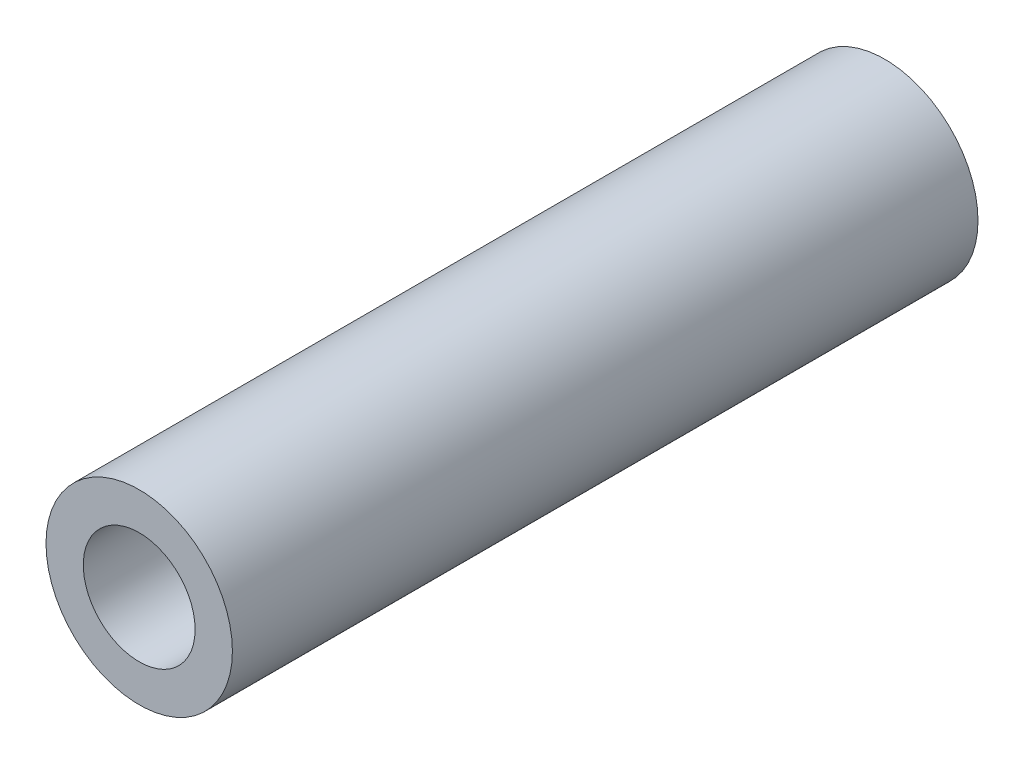
ISO-10303-21;
HEADER;
FILE_DESCRIPTION(('STEP AP214'),'2;1');
FILE_NAME('part.step','',(''),(''),'','','');
FILE_SCHEMA(('AUTOMOTIVE_DESIGN { 1 0 10303 214 1 1 1 1 }'));
ENDSEC;
DATA;
#1=APPLICATION_CONTEXT('core data for automotive mechanical design processes');
#2=APPLICATION_PROTOCOL_DEFINITION('international standard','automotive_design',2000,#1);
#3=PRODUCT_CONTEXT('',#1,'mechanical');
#4=PRODUCT('Part','Part','',(#3));
#5=PRODUCT_RELATED_PRODUCT_CATEGORY('part','',(#4));
#6=PRODUCT_DEFINITION_FORMATION('','',#4);
#7=PRODUCT_DEFINITION_CONTEXT('part definition',#1,'design');
#8=PRODUCT_DEFINITION('design','',#6,#7);
#9=PRODUCT_DEFINITION_SHAPE('','',#8);
#10=(LENGTH_UNIT() NAMED_UNIT(*) SI_UNIT(.MILLI.,.METRE.));
#11=(NAMED_UNIT(*) PLANE_ANGLE_UNIT() SI_UNIT($,.RADIAN.));
#12=(NAMED_UNIT(*) SI_UNIT($,.STERADIAN.) SOLID_ANGLE_UNIT());
#13=UNCERTAINTY_MEASURE_WITH_UNIT(LENGTH_MEASURE(1.E-05),#10,'distance_accuracy_value','');
#14=(GEOMETRIC_REPRESENTATION_CONTEXT(3) GLOBAL_UNCERTAINTY_ASSIGNED_CONTEXT((#13)) GLOBAL_UNIT_ASSIGNED_CONTEXT((#10,
#11,#12)) REPRESENTATION_CONTEXT('',''));
#15=CARTESIAN_POINT('',(0.,0.,0.));
#16=DIRECTION('',(0.,0.,1.));
#17=DIRECTION('',(1.,0.,0.));
#18=AXIS2_PLACEMENT_3D('',#15,#16,#17);
#19=CARTESIAN_POINT('',(0.,0.,10.));
#20=DIRECTION('',(0.,0.,1.));
#21=DIRECTION('',(1.,0.,0.));
#22=AXIS2_PLACEMENT_3D('',#19,#20,#21);
#23=PLANE('',#22);
#24=CARTESIAN_POINT('',(0.,0.,10.));
#25=DIRECTION('',(0.,0.,1.));
#26=DIRECTION('',(1.,0.,0.));
#27=AXIS2_PLACEMENT_3D('',#24,#25,#26);
#28=CIRCLE('',#27,2.5);
#29=CARTESIAN_POINT('',(2.5,0.,10.));
#30=VERTEX_POINT('',#29);
#31=EDGE_CURVE('E10',#30,#30,#28,.T.);
#32=ORIENTED_EDGE('',*,*,#31,.T.);
#33=EDGE_LOOP('',(#32));
#34=FACE_BOUND('',#33,.T.);
#35=CARTESIAN_POINT('',(0.,0.,10.));
#36=DIRECTION('',(0.,0.,1.));
#37=DIRECTION('',(1.,0.,0.));
#38=AXIS2_PLACEMENT_3D('',#35,#36,#37);
#39=CIRCLE('',#38,1.5);
#40=CARTESIAN_POINT('',(1.5,0.,10.));
#41=VERTEX_POINT('',#40);
#42=EDGE_CURVE('E41',#41,#41,#39,.T.);
#43=ORIENTED_EDGE('',*,*,#42,.F.);
#44=EDGE_LOOP('',(#43));
#45=FACE_BOUND('',#44,.T.);
#46=ADVANCED_FACE('F30',(#34,#45),#23,.T.);
#47=CARTESIAN_POINT('',(0.,0.,-10.));
#48=DIRECTION('',(0.,0.,1.));
#49=DIRECTION('',(1.,0.,0.));
#50=AXIS2_PLACEMENT_3D('',#47,#48,#49);
#51=PLANE('',#50);
#52=CARTESIAN_POINT('',(0.,0.,-10.));
#53=DIRECTION('',(0.,0.,1.));
#54=DIRECTION('',(1.,0.,0.));
#55=AXIS2_PLACEMENT_3D('',#52,#53,#54);
#56=CIRCLE('',#55,2.5);
#57=CARTESIAN_POINT('',(2.5,0.,-10.));
#58=VERTEX_POINT('',#57);
#59=EDGE_CURVE('E34',#58,#58,#56,.T.);
#60=ORIENTED_EDGE('',*,*,#59,.F.);
#61=EDGE_LOOP('',(#60));
#62=FACE_BOUND('',#61,.T.);
#63=CARTESIAN_POINT('',(0.,0.,-10.));
#64=DIRECTION('',(0.,0.,1.));
#65=DIRECTION('',(1.,0.,0.));
#66=AXIS2_PLACEMENT_3D('',#63,#64,#65);
#67=CIRCLE('',#66,1.5);
#68=CARTESIAN_POINT('',(1.5,0.,-10.));
#69=VERTEX_POINT('',#68);
#70=EDGE_CURVE('E43',#69,#69,#67,.T.);
#71=ORIENTED_EDGE('',*,*,#70,.T.);
#72=EDGE_LOOP('',(#71));
#73=FACE_BOUND('',#72,.T.);
#74=ADVANCED_FACE('F53',(#62,#73),#51,.F.);
#75=CARTESIAN_POINT('',(0.,0.,10.));
#76=DIRECTION('',(0.,0.,-1.));
#77=DIRECTION('',(-1.,0.,0.));
#78=AXIS2_PLACEMENT_3D('',#75,#76,#77);
#79=CYLINDRICAL_SURFACE('',#78,2.5);
#80=ORIENTED_EDGE('',*,*,#31,.F.);
#81=EDGE_LOOP('',(#80));
#82=FACE_BOUND('',#81,.T.);
#83=ORIENTED_EDGE('',*,*,#59,.T.);
#84=EDGE_LOOP('',(#83));
#85=FACE_BOUND('',#84,.T.);
#86=ADVANCED_FACE('F32',(#82,#85),#79,.T.);
#87=CARTESIAN_POINT('',(0.,0.,10.));
#88=DIRECTION('',(0.,0.,-1.));
#89=DIRECTION('',(-1.,0.,0.));
#90=AXIS2_PLACEMENT_3D('',#87,#88,#89);
#91=CYLINDRICAL_SURFACE('',#90,1.5);
#92=ORIENTED_EDGE('',*,*,#42,.T.);
#93=EDGE_LOOP('',(#92));
#94=FACE_BOUND('',#93,.T.);
#95=ORIENTED_EDGE('',*,*,#70,.F.);
#96=EDGE_LOOP('',(#95));
#97=FACE_BOUND('',#96,.T.);
#98=ADVANCED_FACE('F49',(#94,#97),#91,.F.);
#99=CLOSED_SHELL('',(#46,#74,#86,#98));
#100=MANIFOLD_SOLID_BREP('B2',#99);
#101=ADVANCED_BREP_SHAPE_REPRESENTATION('',(#18,#100),#14);
#102=SHAPE_DEFINITION_REPRESENTATION(#9,#101);
ENDSEC;
END-ISO-10303-21;
